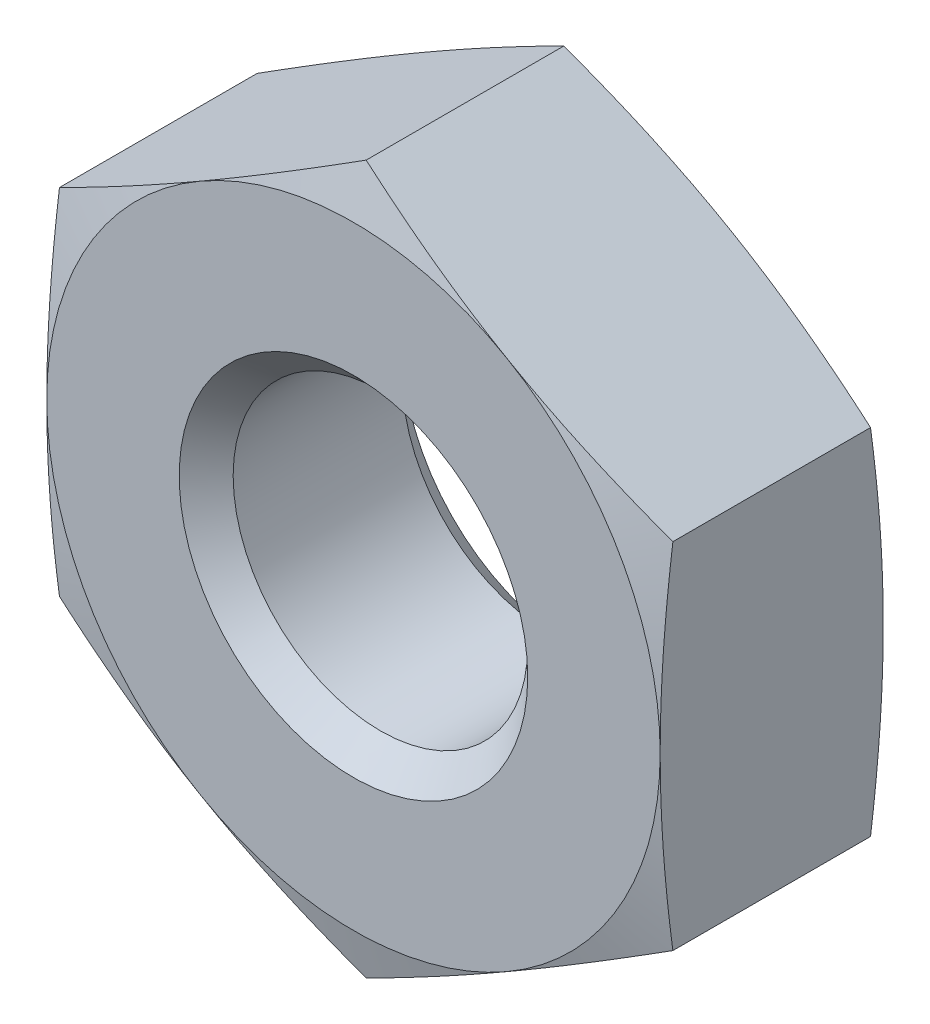
ISO-10303-21;
HEADER;
FILE_DESCRIPTION(('STEP AP214'),'2;1');
FILE_NAME('part.step','',(''),(''),'','','');
FILE_SCHEMA(('AUTOMOTIVE_DESIGN { 1 0 10303 214 1 1 1 1 }'));
ENDSEC;
DATA;
#1=APPLICATION_CONTEXT('core data for automotive mechanical design processes');
#2=APPLICATION_PROTOCOL_DEFINITION('international standard','automotive_design',2000,#1);
#3=PRODUCT_CONTEXT('',#1,'mechanical');
#4=PRODUCT('Part','Part','',(#3));
#5=PRODUCT_RELATED_PRODUCT_CATEGORY('part','',(#4));
#6=PRODUCT_DEFINITION_FORMATION('','',#4);
#7=PRODUCT_DEFINITION_CONTEXT('part definition',#1,'design');
#8=PRODUCT_DEFINITION('design','',#6,#7);
#9=PRODUCT_DEFINITION_SHAPE('','',#8);
#10=(LENGTH_UNIT() NAMED_UNIT(*) SI_UNIT(.MILLI.,.METRE.));
#11=(NAMED_UNIT(*) PLANE_ANGLE_UNIT() SI_UNIT($,.RADIAN.));
#12=(NAMED_UNIT(*) SI_UNIT($,.STERADIAN.) SOLID_ANGLE_UNIT());
#13=UNCERTAINTY_MEASURE_WITH_UNIT(LENGTH_MEASURE(1.E-05),#10,'distance_accuracy_value','');
#14=(GEOMETRIC_REPRESENTATION_CONTEXT(3) GLOBAL_UNCERTAINTY_ASSIGNED_CONTEXT((#13)) GLOBAL_UNIT_ASSIGNED_CONTEXT((#10,
#11,#12)) REPRESENTATION_CONTEXT('',''));
#15=CARTESIAN_POINT('',(0.,0.,0.));
#16=DIRECTION('',(0.,0.,1.));
#17=DIRECTION('',(1.,0.,0.));
#18=AXIS2_PLACEMENT_3D('',#15,#16,#17);
#19=CARTESIAN_POINT('',(0.,5.588,-4.064));
#20=DIRECTION('',(0.,0.,1.));
#21=DIRECTION('',(1.,0.,0.));
#22=AXIS2_PLACEMENT_3D('',#19,#20,#21);
#23=PLANE('',#22);
#24=CARTESIAN_POINT('',(0.,0.,-4.064000000026));
#25=DIRECTION('',(0.,0.,1.));
#26=DIRECTION('',(1.,0.,0.));
#27=AXIS2_PLACEMENT_3D('',#24,#25,#26);
#28=CIRCLE('',#27,5.58799999998882);
#29=CARTESIAN_POINT('',(2.7939999999972,4.83934995634261,-4.06400000002451));
#30=VERTEX_POINT('',#29);
#31=CARTESIAN_POINT('',(-2.7939999999972,4.8393499563426,-4.06400000002451));
#32=VERTEX_POINT('',#31);
#33=EDGE_CURVE('E131',#30,#32,#28,.T.);
#34=ORIENTED_EDGE('',*,*,#33,.F.);
#35=CARTESIAN_POINT('',(0.,0.,-4.064000000026));
#36=DIRECTION('',(0.,0.,1.));
#37=DIRECTION('',(1.,0.,0.));
#38=AXIS2_PLACEMENT_3D('',#35,#36,#37);
#39=CIRCLE('',#38,5.58799999998882);
#40=CARTESIAN_POINT('',(5.58799999999441,0.,-4.06400000002451));
#41=VERTEX_POINT('',#40);
#42=EDGE_CURVE('E128',#41,#30,#39,.T.);
#43=ORIENTED_EDGE('',*,*,#42,.F.);
#44=CARTESIAN_POINT('',(0.,0.,-4.064000000026));
#45=DIRECTION('',(0.,0.,1.));
#46=DIRECTION('',(1.,0.,0.));
#47=AXIS2_PLACEMENT_3D('',#44,#45,#46);
#48=CIRCLE('',#47,5.58799999998882);
#49=CARTESIAN_POINT('',(2.7939999999972,-4.83934995634261,-4.06400000002451));
#50=VERTEX_POINT('',#49);
#51=EDGE_CURVE('E20',#50,#41,#48,.T.);
#52=ORIENTED_EDGE('',*,*,#51,.F.);
#53=CARTESIAN_POINT('',(0.,0.,-4.064000000026));
#54=DIRECTION('',(0.,0.,1.));
#55=DIRECTION('',(1.,0.,0.));
#56=AXIS2_PLACEMENT_3D('',#53,#54,#55);
#57=CIRCLE('',#56,5.58799999998882);
#58=CARTESIAN_POINT('',(-2.7939999999972,-4.83934995634261,-4.06400000002451));
#59=VERTEX_POINT('',#58);
#60=EDGE_CURVE('E104',#59,#50,#57,.T.);
#61=ORIENTED_EDGE('',*,*,#60,.F.);
#62=CARTESIAN_POINT('',(0.,0.,-4.064000000026));
#63=DIRECTION('',(0.,0.,1.));
#64=DIRECTION('',(1.,0.,0.));
#65=AXIS2_PLACEMENT_3D('',#62,#63,#64);
#66=CIRCLE('',#65,5.58799999998882);
#67=CARTESIAN_POINT('',(-5.58799999999441,0.,-4.06400000002451));
#68=VERTEX_POINT('',#67);
#69=EDGE_CURVE('E136',#68,#59,#66,.T.);
#70=ORIENTED_EDGE('',*,*,#69,.F.);
#71=CARTESIAN_POINT('',(0.,0.,-4.064000000026));
#72=DIRECTION('',(0.,0.,1.));
#73=DIRECTION('',(1.,0.,0.));
#74=AXIS2_PLACEMENT_3D('',#71,#72,#73);
#75=CIRCLE('',#74,5.58799999998882);
#76=EDGE_CURVE('E412',#32,#68,#75,.T.);
#77=ORIENTED_EDGE('',*,*,#76,.F.);
#78=EDGE_LOOP('',(#34,#43,#52,#61,#70,#77));
#79=FACE_BOUND('',#78,.T.);
#80=CARTESIAN_POINT('',(0.,0.,-4.06400000002805));
#81=DIRECTION('',(0.,0.,-1.));
#82=DIRECTION('',(-1.,0.,0.));
#83=AXIS2_PLACEMENT_3D('',#80,#81,#82);
#84=CIRCLE('',#83,3.17499999999882);
#85=CARTESIAN_POINT('',(-3.17499999999882,0.,-4.06400000002805));
#86=VERTEX_POINT('',#85);
#87=EDGE_CURVE('E125',#86,#86,#84,.F.);
#88=ORIENTED_EDGE('',*,*,#87,.T.);
#89=EDGE_LOOP('',(#88));
#90=FACE_BOUND('',#89,.T.);
#91=ADVANCED_FACE('F17',(#79,#90),#23,.F.);
#92=CARTESIAN_POINT('',(0.,0.,-3.83097707165803));
#93=DIRECTION('',(0.,0.,1.));
#94=DIRECTION('',(1.,0.,0.));
#95=AXIS2_PLACEMENT_3D('',#92,#93,#94);
#96=CONICAL_SURFACE('',#95,6.45765340800608,1.30899693900135);
#97=CARTESIAN_POINT('',(2.79399999999999,-4.83934995634744,-4.06400000002301));
#98=CARTESIAN_POINT('',(2.91089048197917,-4.77186320511105,-4.06400613805041));
#99=CARTESIAN_POINT('',(3.02777767203443,-4.70437835446783,-4.06268908124278));
#100=CARTESIAN_POINT('',(3.26150490328894,-4.56943587458609,-4.0574605147276));
#101=CARTESIAN_POINT('',(3.3783449458841,-4.50197824454165,-4.05354908849101));
#102=CARTESIAN_POINT('',(3.72847238563638,-4.29983207295,-4.03801311347));
#103=CARTESIAN_POINT('',(3.96163987483682,-4.16521276029386,-4.02258663373282));
#104=CARTESIAN_POINT('',(4.42730452197151,-3.89636115091855,-3.98253825882312));
#105=CARTESIAN_POINT('',(4.65980182496363,-3.76212877045019,-3.95791853210183));
#106=CARTESIAN_POINT('',(5.12433854928225,-3.49392836761637,-3.90075946318869));
#107=CARTESIAN_POINT('',(5.35637714733395,-3.35996082056883,-3.86821113150756));
#108=CARTESIAN_POINT('',(5.58800000000257,-3.22623330423014,-3.8323668704064));
#109=B_SPLINE_CURVE_WITH_KNOTS('',3,(#97,#98,#99,#100,#101,#102,#103,#104,#105,#106,#107,#108),
.UNSPECIFIED.,.F.,.F.,(4,2,2,2,2,4),(0.,0.404906880860233,0.809800734922586,1.61864413081672,
2.42729686168546,3.23687074950759),.UNSPECIFIED.);
#110=CARTESIAN_POINT('',(5.58800000000161,-3.22623330423255,-3.8323668704063));
#111=VERTEX_POINT('',#110);
#112=EDGE_CURVE('E115',#50,#111,#109,.T.);
#113=ORIENTED_EDGE('',*,*,#112,.F.);
#114=ORIENTED_EDGE('',*,*,#51,.T.);
#115=CARTESIAN_POINT('',(5.58799999999305,-3.22623330423461,-3.83236687040081));
#116=CARTESIAN_POINT('',(5.58799999999751,-2.95877827155755,-3.86821113150552));
#117=CARTESIAN_POINT('',(5.58799999999933,-2.69084317746257,-3.9007594631881));
#118=CARTESIAN_POINT('',(5.58800000000067,-2.1544423717949,-3.95791853210232));
#119=CARTESIAN_POINT('',(5.58800000000018,-1.88597761085806,-3.98253825882323));
#120=CARTESIAN_POINT('',(5.58799999999983,-1.34827439210734,-4.02258663373267));
#121=CARTESIAN_POINT('',(5.58799999999997,-1.07903576679505,-4.03801311346996));
#122=CARTESIAN_POINT('',(5.58800000000002,-0.674743423611711,-4.05354908849102));
#123=CARTESIAN_POINT('',(5.58800000000001,-0.539828163522803,-4.05746051472761));
#124=CARTESIAN_POINT('',(5.58799999999999,-0.269943203759274,-4.06268908124277));
#125=CARTESIAN_POINT('',(5.58799999999998,-0.134973502472803,-4.0640061380504));
#126=CARTESIAN_POINT('',(5.588,0.,-4.06400000002301));
#127=B_SPLINE_CURVE_WITH_KNOTS('',3,(#115,#116,#117,#118,#119,#120,#121,#122,#123,#124,#125,
#126),.UNSPECIFIED.,.F.,.F.,(4,2,2,2,2,4),(0.,0.809573887822391,1.61822661869133,
2.42707001458552,2.83196386864794,3.23687074950825),.UNSPECIFIED.);
#128=EDGE_CURVE('E113',#111,#41,#127,.T.);
#129=ORIENTED_EDGE('',*,*,#128,.F.);
#130=EDGE_LOOP('',(#113,#114,#129));
#131=FACE_BOUND('',#130,.T.);
#132=ADVANCED_FACE('F112',(#131),#96,.T.);
#133=CARTESIAN_POINT('',(0.,0.,-3.83097707165803));
#134=DIRECTION('',(0.,0.,1.));
#135=DIRECTION('',(1.,0.,0.));
#136=AXIS2_PLACEMENT_3D('',#133,#134,#135);
#137=CONICAL_SURFACE('',#136,6.45765340800608,1.30899693900135);
#138=CARTESIAN_POINT('',(-2.794,-4.83934995634745,-4.06400000002301));
#139=CARTESIAN_POINT('',(-2.67710951802081,-4.90683670758384,-4.06400613805041));
#140=CARTESIAN_POINT('',(-2.56022232796556,-4.97432155822706,-4.06268908124278));
#141=CARTESIAN_POINT('',(-2.32649509671105,-5.1092640381088,-4.0574605147276));
#142=CARTESIAN_POINT('',(-2.20965505411589,-5.17672166815324,-4.05354908849101));
#143=CARTESIAN_POINT('',(-1.85952761436361,-5.37886783974489,-4.03801311347));
#144=CARTESIAN_POINT('',(-1.62636012516317,-5.51348715240103,-4.02258663373282));
#145=CARTESIAN_POINT('',(-1.16069547802849,-5.78233876177633,-3.98253825882312));
#146=CARTESIAN_POINT('',(-0.928198175036369,-5.9165711422447,-3.95791853210183));
#147=CARTESIAN_POINT('',(-0.46366145071775,-6.18477154507852,-3.90075946318868));
#148=CARTESIAN_POINT('',(-0.231622852666047,-6.31873909212605,-3.86821113150756));
#149=CARTESIAN_POINT('',(2.5725689760497E-12,-6.45246660846475,-3.8323668704064));
#150=B_SPLINE_CURVE_WITH_KNOTS('',3,(#138,#139,#140,#141,#142,#143,#144,#145,#146,#147,#148,
#149),.UNSPECIFIED.,.F.,.F.,(4,2,2,2,2,4),(0.,0.404906880860231,0.809800734922583,
1.61864413081671,2.42729686168545,3.23687074950758),.UNSPECIFIED.);
#151=CARTESIAN_POINT('',(0.,-6.45246660846511,-3.8323668704063));
#152=VERTEX_POINT('',#151);
#153=EDGE_CURVE('E276',#59,#152,#150,.T.);
#154=ORIENTED_EDGE('',*,*,#153,.F.);
#155=ORIENTED_EDGE('',*,*,#60,.T.);
#156=CARTESIAN_POINT('',(-6.06003807704887E-12,-6.45246660845872,-3.83236687040082));
#157=CARTESIAN_POINT('',(0.231622852664497,-6.31873909212406,-3.86821113150552));
#158=CARTESIAN_POINT('',(0.463661450717038,-6.18477154507814,-3.9007594631881));
#159=CARTESIAN_POINT('',(0.928198175036345,-5.91657114224546,-3.95791853210233));
#160=CARTESIAN_POINT('',(1.16069547802832,-5.78233876177662,-3.98253825882324));
#161=CARTESIAN_POINT('',(1.62636012516292,-5.51348715240096,-4.02258663373267));
#162=CARTESIAN_POINT('',(1.85952761436344,-5.37886783974494,-4.03801311346997));
#163=CARTESIAN_POINT('',(2.20965505411577,-5.17672166815331,-4.05354908849102));
#164=CARTESIAN_POINT('',(2.32649509671095,-5.10926403810885,-4.05746051472761));
#165=CARTESIAN_POINT('',(2.56022232796549,-4.97432155822707,-4.06268908124278));
#166=CARTESIAN_POINT('',(2.67710951802077,-4.90683670758383,-4.0640061380504));
#167=CARTESIAN_POINT('',(2.79399999999999,-4.83934995634744,-4.06400000002301));
#168=B_SPLINE_CURVE_WITH_KNOTS('',3,(#156,#157,#158,#159,#160,#161,#162,#163,#164,#165,#166,
#167),.UNSPECIFIED.,.F.,.F.,(4,2,2,2,2,4),(0.,0.809573887822391,1.61822661869133,
2.42707001458551,2.83196386864793,3.23687074950825),.UNSPECIFIED.);
#169=EDGE_CURVE('E140',#152,#50,#168,.T.);
#170=ORIENTED_EDGE('',*,*,#169,.F.);
#171=EDGE_LOOP('',(#154,#155,#170));
#172=FACE_BOUND('',#171,.T.);
#173=ADVANCED_FACE('F289',(#172),#137,.T.);
#174=CARTESIAN_POINT('',(0.,0.,-3.83097707165803));
#175=DIRECTION('',(0.,0.,1.));
#176=DIRECTION('',(1.,0.,0.));
#177=AXIS2_PLACEMENT_3D('',#174,#175,#176);
#178=CONICAL_SURFACE('',#177,6.45765340800608,1.30899693900135);
#179=ORIENTED_EDGE('',*,*,#69,.T.);
#180=CARTESIAN_POINT('',(-5.5879999999991,-3.22623330422413,-3.83236687040081));
#181=CARTESIAN_POINT('',(-5.35637714733301,-3.35996082056652,-3.86821113150551));
#182=CARTESIAN_POINT('',(-5.12433854928229,-3.49392836761559,-3.9007594631881));
#183=CARTESIAN_POINT('',(-4.65980182496431,-3.76212877045058,-3.95791853210232));
#184=CARTESIAN_POINT('',(-4.42730452197185,-3.89636115091857,-3.98253825882323));
#185=CARTESIAN_POINT('',(-3.96163987483689,-4.16521276029363,-4.02258663373267));
#186=CARTESIAN_POINT('',(-3.72847238563652,-4.29983207294989,-4.03801311346996));
#187=CARTESIAN_POINT('',(-3.37834494588424,-4.50197824454161,-4.05354908849102));
#188=CARTESIAN_POINT('',(-3.26150490328905,-4.56943587458606,-4.05746051472761));
#189=CARTESIAN_POINT('',(-3.02777767203448,-4.70437835446781,-4.06268908124277));
#190=CARTESIAN_POINT('',(-2.9108904819792,-4.77186320511103,-4.0640061380504));
#191=CARTESIAN_POINT('',(-2.794,-4.83934995634745,-4.06400000002301));
#192=B_SPLINE_CURVE_WITH_KNOTS('',3,(#180,#181,#182,#183,#184,#185,#186,#187,#188,#189,#190,
#191),.UNSPECIFIED.,.F.,.F.,(4,2,2,2,2,4),(0.,0.809573887822391,1.61822661869133,
2.42707001458552,2.83196386864794,3.23687074950825),.UNSPECIFIED.);
#193=CARTESIAN_POINT('',(-5.58800000000161,-3.22623330423256,-3.8323668704063));
#194=VERTEX_POINT('',#193);
#195=EDGE_CURVE('E281',#194,#59,#192,.T.);
#196=ORIENTED_EDGE('',*,*,#195,.F.);
#197=CARTESIAN_POINT('',(-5.588,0.,-4.06400000002301));
#198=CARTESIAN_POINT('',(-5.588,-0.134973502472776,-4.06400613805041));
#199=CARTESIAN_POINT('',(-5.588,-0.269943203759218,-4.06268908124278));
#200=CARTESIAN_POINT('',(-5.588,-0.539828163522696,-4.0574605147276));
#201=CARTESIAN_POINT('',(-5.588,-0.674743423611582,-4.05354908849101));
#202=CARTESIAN_POINT('',(-5.588,-1.07903576679489,-4.03801311347));
#203=CARTESIAN_POINT('',(-5.588,-1.34827439210717,-4.02258663373282));
#204=CARTESIAN_POINT('',(-5.588,-1.88597761085778,-3.98253825882312));
#205=CARTESIAN_POINT('',(-5.588,-2.1544423717945,-3.95791853210183));
#206=CARTESIAN_POINT('',(-5.588,-2.69084317746215,-3.90075946318868));
#207=CARTESIAN_POINT('',(-5.588,-2.95877827155722,-3.86821113150756));
#208=CARTESIAN_POINT('',(-5.588,-3.22623330423461,-3.8323668704064));
#209=B_SPLINE_CURVE_WITH_KNOTS('',3,(#197,#198,#199,#200,#201,#202,#203,#204,#205,#206,#207,
#208),.UNSPECIFIED.,.F.,.F.,(4,2,2,2,2,4),(0.,0.404906880860233,0.809800734922587,
1.61864413081672,2.42729686168547,3.23687074950759),.UNSPECIFIED.);
#210=EDGE_CURVE('E183',#68,#194,#209,.T.);
#211=ORIENTED_EDGE('',*,*,#210,.F.);
#212=EDGE_LOOP('',(#179,#196,#211));
#213=FACE_BOUND('',#212,.T.);
#214=ADVANCED_FACE('F165',(#213),#178,.T.);
#215=CARTESIAN_POINT('',(0.,0.,-3.83097707165803));
#216=DIRECTION('',(0.,0.,1.));
#217=DIRECTION('',(1.,0.,0.));
#218=AXIS2_PLACEMENT_3D('',#215,#216,#217);
#219=CONICAL_SURFACE('',#218,6.45765340800608,1.30899693900135);
#220=CARTESIAN_POINT('',(5.588,0.,-4.06400000002301));
#221=CARTESIAN_POINT('',(5.588,0.134973502472776,-4.06400613805041));
#222=CARTESIAN_POINT('',(5.588,0.269943203759219,-4.06268908124278));
#223=CARTESIAN_POINT('',(5.588,0.539828163522697,-4.0574605147276));
#224=CARTESIAN_POINT('',(5.588,0.674743423611582,-4.05354908849101));
#225=CARTESIAN_POINT('',(5.588,1.07903576679489,-4.03801311347));
#226=CARTESIAN_POINT('',(5.588,1.34827439210717,-4.02258663373282));
#227=CARTESIAN_POINT('',(5.588,1.88597761085778,-3.98253825882312));
#228=CARTESIAN_POINT('',(5.588,2.1544423717945,-3.95791853210183));
#229=CARTESIAN_POINT('',(5.588,2.69084317746215,-3.90075946318868));
#230=CARTESIAN_POINT('',(5.588,2.95877827155722,-3.86821113150756));
#231=CARTESIAN_POINT('',(5.588,3.22623330423461,-3.8323668704064));
#232=B_SPLINE_CURVE_WITH_KNOTS('',3,(#220,#221,#222,#223,#224,#225,#226,#227,#228,#229,#230,
#231),.UNSPECIFIED.,.F.,.F.,(4,2,2,2,2,4),(0.,0.404906880860234,0.809800734922587,
1.61864413081672,2.42729686168547,3.23687074950759),.UNSPECIFIED.);
#233=CARTESIAN_POINT('',(5.588,3.22623330423349,-3.83236687040655));
#234=VERTEX_POINT('',#233);
#235=EDGE_CURVE('E121',#41,#234,#232,.T.);
#236=ORIENTED_EDGE('',*,*,#235,.F.);
#237=ORIENTED_EDGE('',*,*,#42,.T.);
#238=CARTESIAN_POINT('',(5.5879999999991,3.22623330422413,-3.83236687040081));
#239=CARTESIAN_POINT('',(5.356377147333,3.35996082056652,-3.86821113150551));
#240=CARTESIAN_POINT('',(5.12433854928229,3.49392836761559,-3.9007594631881));
#241=CARTESIAN_POINT('',(4.65980182496431,3.76212877045058,-3.95791853210232));
#242=CARTESIAN_POINT('',(4.42730452197185,3.89636115091857,-3.98253825882323));
#243=CARTESIAN_POINT('',(3.96163987483689,4.16521276029363,-4.02258663373267));
#244=CARTESIAN_POINT('',(3.72847238563652,4.29983207294989,-4.03801311346996));
#245=CARTESIAN_POINT('',(3.37834494588423,4.50197824454161,-4.05354908849102));
#246=CARTESIAN_POINT('',(3.26150490328905,4.56943587458606,-4.05746051472761));
#247=CARTESIAN_POINT('',(3.02777767203448,4.70437835446781,-4.06268908124277));
#248=CARTESIAN_POINT('',(2.9108904819792,4.77186320511104,-4.0640061380504));
#249=CARTESIAN_POINT('',(2.794,4.83934995634745,-4.06400000002301));
#250=B_SPLINE_CURVE_WITH_KNOTS('',3,(#238,#239,#240,#241,#242,#243,#244,#245,#246,#247,#248,
#249),.UNSPECIFIED.,.F.,.F.,(4,2,2,2,2,4),(0.,0.809573887822392,1.61822661869133,
2.42707001458552,2.83196386864794,3.23687074950826),.UNSPECIFIED.);
#251=EDGE_CURVE('E139',#234,#30,#250,.T.);
#252=ORIENTED_EDGE('',*,*,#251,.F.);
#253=EDGE_LOOP('',(#236,#237,#252));
#254=FACE_BOUND('',#253,.T.);
#255=ADVANCED_FACE('F138',(#254),#219,.T.);
#256=CARTESIAN_POINT('',(0.,0.,-3.83097707165803));
#257=DIRECTION('',(0.,0.,1.));
#258=DIRECTION('',(1.,0.,0.));
#259=AXIS2_PLACEMENT_3D('',#256,#257,#258);
#260=CONICAL_SURFACE('',#259,6.45765340800608,1.30899693900135);
#261=CARTESIAN_POINT('',(2.794,4.83934995634745,-4.06400000002301));
#262=CARTESIAN_POINT('',(2.67710951802081,4.90683670758384,-4.06400613805041));
#263=CARTESIAN_POINT('',(2.56022232796556,4.97432155822706,-4.06268908124278));
#264=CARTESIAN_POINT('',(2.32649509671104,5.1092640381088,-4.0574605147276));
#265=CARTESIAN_POINT('',(2.20965505411589,5.17672166815324,-4.05354908849101));
#266=CARTESIAN_POINT('',(1.85952761436361,5.37886783974489,-4.03801311347));
#267=CARTESIAN_POINT('',(1.62636012516317,5.51348715240103,-4.02258663373282));
#268=CARTESIAN_POINT('',(1.16069547802849,5.78233876177633,-3.98253825882312));
#269=CARTESIAN_POINT('',(0.928198175036368,5.9165711422447,-3.95791853210183));
#270=CARTESIAN_POINT('',(0.463661450717749,6.18477154507852,-3.90075946318868));
#271=CARTESIAN_POINT('',(0.231622852666046,6.31873909212605,-3.86821113150756));
#272=CARTESIAN_POINT('',(-2.57232619679129E-12,6.45246660846475,-3.8323668704064));
#273=B_SPLINE_CURVE_WITH_KNOTS('',3,(#261,#262,#263,#264,#265,#266,#267,#268,#269,#270,#271,
#272),.UNSPECIFIED.,.F.,.F.,(4,2,2,2,2,4),(0.,0.404906880860231,0.809800734922582,
1.61864413081671,2.42729686168545,3.23687074950757),.UNSPECIFIED.);
#274=CARTESIAN_POINT('',(-1.60443338014632E-12,6.45246660846418,-3.83236687040655));
#275=VERTEX_POINT('',#274);
#276=EDGE_CURVE('E177',#30,#275,#273,.T.);
#277=ORIENTED_EDGE('',*,*,#276,.F.);
#278=ORIENTED_EDGE('',*,*,#33,.T.);
#279=CARTESIAN_POINT('',(6.05815025700102E-12,6.45246660845872,-3.83236687040082));
#280=CARTESIAN_POINT('',(-0.231622852664499,6.31873909212405,-3.86821113150552));
#281=CARTESIAN_POINT('',(-0.46366145071704,6.18477154507814,-3.9007594631881));
#282=CARTESIAN_POINT('',(-0.928198175036347,5.91657114224546,-3.95791853210233));
#283=CARTESIAN_POINT('',(-1.16069547802832,5.78233876177662,-3.98253825882324));
#284=CARTESIAN_POINT('',(-1.62636012516292,5.51348715240096,-4.02258663373267));
#285=CARTESIAN_POINT('',(-1.85952761436344,5.37886783974494,-4.03801311346997));
#286=CARTESIAN_POINT('',(-2.20965505411577,5.17672166815331,-4.05354908849102));
#287=CARTESIAN_POINT('',(-2.32649509671095,5.10926403810885,-4.05746051472761));
#288=CARTESIAN_POINT('',(-2.5602223279655,4.97432155822707,-4.06268908124278));
#289=CARTESIAN_POINT('',(-2.67710951802077,4.90683670758383,-4.0640061380504));
#290=CARTESIAN_POINT('',(-2.79399999999999,4.83934995634744,-4.06400000002301));
#291=B_SPLINE_CURVE_WITH_KNOTS('',3,(#279,#280,#281,#282,#283,#284,#285,#286,#287,#288,#289,
#290),.UNSPECIFIED.,.F.,.F.,(4,2,2,2,2,4),(0.,0.80957388782239,1.61822661869133,
2.42707001458551,2.83196386864793,3.23687074950825),.UNSPECIFIED.);
#292=EDGE_CURVE('E343',#275,#32,#291,.T.);
#293=ORIENTED_EDGE('',*,*,#292,.F.);
#294=EDGE_LOOP('',(#277,#278,#293));
#295=FACE_BOUND('',#294,.T.);
#296=ADVANCED_FACE('F164',(#295),#260,.T.);
#297=CARTESIAN_POINT('',(0.,0.,-3.83097707165803));
#298=DIRECTION('',(0.,0.,1.));
#299=DIRECTION('',(1.,0.,0.));
#300=AXIS2_PLACEMENT_3D('',#297,#298,#299);
#301=CONICAL_SURFACE('',#300,6.45765340800608,1.30899693900135);
#302=ORIENTED_EDGE('',*,*,#76,.T.);
#303=CARTESIAN_POINT('',(-5.58799999999305,3.22623330423461,-3.83236687040081));
#304=CARTESIAN_POINT('',(-5.58799999999751,2.95877827155755,-3.86821113150552));
#305=CARTESIAN_POINT('',(-5.58799999999933,2.69084317746257,-3.9007594631881));
#306=CARTESIAN_POINT('',(-5.58800000000067,2.1544423717949,-3.95791853210232));
#307=CARTESIAN_POINT('',(-5.58800000000018,1.88597761085806,-3.98253825882323));
#308=CARTESIAN_POINT('',(-5.58799999999983,1.34827439210734,-4.02258663373267));
#309=CARTESIAN_POINT('',(-5.58799999999997,1.07903576679505,-4.03801311346996));
#310=CARTESIAN_POINT('',(-5.58800000000002,0.674743423611712,-4.05354908849102));
#311=CARTESIAN_POINT('',(-5.58800000000001,0.539828163522803,-4.05746051472761));
#312=CARTESIAN_POINT('',(-5.58799999999999,0.269943203759274,-4.06268908124277));
#313=CARTESIAN_POINT('',(-5.58799999999998,0.134973502472803,-4.0640061380504));
#314=CARTESIAN_POINT('',(-5.588,0.,-4.06400000002301));
#315=B_SPLINE_CURVE_WITH_KNOTS('',3,(#303,#304,#305,#306,#307,#308,#309,#310,#311,#312,#313,
#314),.UNSPECIFIED.,.F.,.F.,(4,2,2,2,2,4),(0.,0.809573887822391,1.61822661869133,
2.42707001458552,2.83196386864794,3.23687074950825),.UNSPECIFIED.);
#316=CARTESIAN_POINT('',(-5.58800000000161,3.22623330423256,-3.8323668704063));
#317=VERTEX_POINT('',#316);
#318=EDGE_CURVE('E282',#317,#68,#315,.T.);
#319=ORIENTED_EDGE('',*,*,#318,.F.);
#320=CARTESIAN_POINT('',(-2.79399999999999,4.83934995634744,-4.06400000002301));
#321=CARTESIAN_POINT('',(-2.91089048197918,4.77186320511105,-4.06400613805041));
#322=CARTESIAN_POINT('',(-3.02777767203443,4.70437835446783,-4.06268908124278));
#323=CARTESIAN_POINT('',(-3.26150490328894,4.56943587458609,-4.0574605147276));
#324=CARTESIAN_POINT('',(-3.37834494588411,4.50197824454165,-4.05354908849101));
#325=CARTESIAN_POINT('',(-3.72847238563639,4.29983207295,-4.03801311347));
#326=CARTESIAN_POINT('',(-3.96163987483682,4.16521276029385,-4.02258663373282));
#327=CARTESIAN_POINT('',(-4.42730452197151,3.89636115091855,-3.98253825882312));
#328=CARTESIAN_POINT('',(-4.65980182496363,3.76212877045019,-3.95791853210183));
#329=CARTESIAN_POINT('',(-5.12433854928225,3.49392836761637,-3.90075946318869));
#330=CARTESIAN_POINT('',(-5.35637714733395,3.35996082056883,-3.86821113150756));
#331=CARTESIAN_POINT('',(-5.58800000000257,3.22623330423014,-3.8323668704064));
#332=B_SPLINE_CURVE_WITH_KNOTS('',3,(#320,#321,#322,#323,#324,#325,#326,#327,#328,#329,#330,
#331),.UNSPECIFIED.,.F.,.F.,(4,2,2,2,2,4),(0.,0.404906880860233,0.809800734922585,
1.61864413081672,2.42729686168546,3.23687074950759),.UNSPECIFIED.);
#333=EDGE_CURVE('E339',#32,#317,#332,.T.);
#334=ORIENTED_EDGE('',*,*,#333,.F.);
#335=EDGE_LOOP('',(#302,#319,#334));
#336=FACE_BOUND('',#335,.T.);
#337=ADVANCED_FACE('F418',(#336),#301,.T.);
#338=CARTESIAN_POINT('',(0.,0.,-4.06400000002805));
#339=DIRECTION('',(0.,0.,-1.));
#340=DIRECTION('',(-1.,0.,0.));
#341=AXIS2_PLACEMENT_3D('',#338,#339,#340);
#342=CONICAL_SURFACE('',#341,3.17499999999882,0.785398163397448);
#343=CARTESIAN_POINT('',(0.,0.,-3.57251));
#344=DIRECTION('',(0.,0.,1.));
#345=DIRECTION('',(1.,0.,0.));
#346=AXIS2_PLACEMENT_3D('',#343,#344,#345);
#347=CIRCLE('',#346,2.68351);
#348=CARTESIAN_POINT('',(2.68351,0.,-3.57251));
#349=VERTEX_POINT('',#348);
#350=EDGE_CURVE('E332',#349,#349,#347,.T.);
#351=ORIENTED_EDGE('',*,*,#350,.T.);
#352=EDGE_LOOP('',(#351));
#353=FACE_BOUND('',#352,.T.);
#354=ORIENTED_EDGE('',*,*,#87,.F.);
#355=EDGE_LOOP('',(#354));
#356=FACE_BOUND('',#355,.T.);
#357=ADVANCED_FACE('F416',(#353,#356),#342,.F.);
#358=CARTESIAN_POINT('',(5.588,-3.22623330423164,-4.064));
#359=DIRECTION('',(1.,0.,0.));
#360=DIRECTION('',(0.,0.,-1.));
#361=AXIS2_PLACEMENT_3D('',#358,#359,#360);
#362=PLANE('',#361);
#363=ORIENTED_EDGE('',*,*,#235,.T.);
#364=DIRECTION('',(0.,0.,1.));
#365=VECTOR('',#364,1.);
#366=CARTESIAN_POINT('',(5.588,3.22623330423164,-4.064));
#367=LINE('',#366,#365);
#368=CARTESIAN_POINT('',(5.588,3.22623332711371,-0.231633132658444));
#369=VERTEX_POINT('',#368);
#370=EDGE_CURVE('E178',#369,#234,#367,.F.);
#371=ORIENTED_EDGE('',*,*,#370,.F.);
#372=CARTESIAN_POINT('',(5.588,0.,2.33865474576924E-11));
#373=CARTESIAN_POINT('',(5.588,0.134973504400605,6.13805113475887E-06));
#374=CARTESIAN_POINT('',(5.588,0.269943207614708,-0.00131091879430666));
#375=CARTESIAN_POINT('',(5.588,0.53982817123107,-0.00653948545847716));
#376=CARTESIAN_POINT('',(5.588,0.67474343324518,-0.0104509118062404));
#377=CARTESIAN_POINT('',(5.588,1.07903578218717,-0.0259868872658269));
#378=CARTESIAN_POINT('',(5.588,1.34827441132708,-0.0414133674354804));
#379=CARTESIAN_POINT('',(5.588,1.88597763770162,-0.0814617434389431));
#380=CARTESIAN_POINT('',(5.588,2.15444240243468,-0.10608147082137));
#381=CARTESIAN_POINT('',(5.588,2.69084321567823,-0.163240541226211));
#382=CARTESIAN_POINT('',(5.588,2.95877831355282,-0.195788873738281));
#383=CARTESIAN_POINT('',(5.588,3.22623334999578,-0.231633135724061));
#384=B_SPLINE_CURVE_WITH_KNOTS('',3,(#372,#373,#374,#375,#376,#377,#378,#379,#380,#381,#382,
#383),.UNSPECIFIED.,.F.,.F.,(4,2,2,2,2,4),(0.,0.404906886643133,0.809800746487453,
1.61864415391211,2.4272968962998,3.2368707956737),.UNSPECIFIED.);
#385=CARTESIAN_POINT('',(5.58799999999441,0.,2.48838229923133E-11));
#386=VERTEX_POINT('',#385);
#387=EDGE_CURVE('E389',#386,#369,#384,.T.);
#388=ORIENTED_EDGE('',*,*,#387,.F.);
#389=CARTESIAN_POINT('',(5.588,-3.22623320762845,-0.231633116650456));
#390=CARTESIAN_POINT('',(5.588,-2.95877818290053,-0.195788857416812));
#391=CARTESIAN_POINT('',(5.588,-2.69084309678439,-0.163240527489882));
#392=CARTESIAN_POINT('',(5.588,-2.15444230711019,-0.106081461725849));
#393=CARTESIAN_POINT('',(5.588,-1.88597755418789,-0.0814617364002843));
#394=CARTESIAN_POINT('',(5.588,-1.34827435153214,-0.0414133637996232));
#395=CARTESIAN_POINT('',(5.588,-1.07903573430032,-0.0259868849754276));
#396=CARTESIAN_POINT('',(5.588,-0.674743403274144,-0.0104509108802863));
#397=CARTESIAN_POINT('',(5.588,-0.53982814724959,-0.00653948487839538));
#398=CARTESIAN_POINT('',(5.588,-0.269943195619917,-0.00131091867774982));
#399=CARTESIAN_POINT('',(5.588,-0.134973498402948,6.1380500611794E-06));
#400=CARTESIAN_POINT('',(5.588,0.,2.33865134630576E-11));
#401=B_SPLINE_CURVE_WITH_KNOTS('',3,(#389,#390,#391,#392,#393,#394,#395,#396,#397,#398,#399,
#400),.UNSPECIFIED.,.F.,.F.,(4,2,2,2,2,4),(0.,0.809573863435232,1.61822656998641,
2.4270699415385,2.83196378339457,3.23687065204656),.UNSPECIFIED.);
#402=CARTESIAN_POINT('',(5.58800001980971,-3.22623329279448,-0.231633132657398));
#403=VERTEX_POINT('',#402);
#404=EDGE_CURVE('E366',#403,#386,#401,.T.);
#405=ORIENTED_EDGE('',*,*,#404,.F.);
#406=DIRECTION('',(0.,0.,1.));
#407=VECTOR('',#406,1.);
#408=CARTESIAN_POINT('',(5.58799999999999,-3.22623330423162,-4.064));
#409=LINE('',#408,#407);
#410=EDGE_CURVE('E124',#111,#403,#409,.T.);
#411=ORIENTED_EDGE('',*,*,#410,.F.);
#412=ORIENTED_EDGE('',*,*,#128,.T.);
#413=EDGE_LOOP('',(#363,#371,#388,#405,#411,#412));
#414=FACE_BOUND('',#413,.T.);
#415=ADVANCED_FACE('F119',(#414),#362,.T.);
#416=CARTESIAN_POINT('',(0.,-6.45246660846325,-4.064));
#417=DIRECTION('',(0.5,-0.866025403784439,0.));
#418=DIRECTION('',(0.866025403784439,0.5,0.));
#419=AXIS2_PLACEMENT_3D('',#416,#417,#418);
#420=PLANE('',#419);
#421=ORIENTED_EDGE('',*,*,#112,.T.);
#422=ORIENTED_EDGE('',*,*,#410,.T.);
#423=CARTESIAN_POINT('',(2.79399999999999,-4.83934995634744,2.33884021902709E-11));
#424=CARTESIAN_POINT('',(2.91089048364816,-4.77186320414746,6.13805113670551E-06));
#425=CARTESIAN_POINT('',(3.02777767537225,-4.70437835254074,-0.00131091879429178));
#426=CARTESIAN_POINT('',(3.26150490996232,-4.56943587073322,-0.00653948545841156));
#427=CARTESIAN_POINT('',(3.37834495422421,-4.50197823972649,-0.010450911806137));
#428=CARTESIAN_POINT('',(3.72847239896196,-4.29983206525647,-0.0259868872655743));
#429=CARTESIAN_POINT('',(3.96163989147608,-4.16521275068717,-0.0414133674350804));
#430=CARTESIAN_POINT('',(4.42730454521104,-3.8963611375012,-0.0814617434381707));
#431=CARTESIAN_POINT('',(4.65980185148976,-3.76212875513532,-0.106081470820373));
#432=CARTESIAN_POINT('',(5.12433858236708,-3.49392834851483,-0.163240541224705));
#433=CARTESIAN_POINT('',(5.35637718369083,-3.35996079957818,-0.195788873736493));
#434=CARTESIAN_POINT('',(5.58800003961941,-3.22623328135734,-0.231633135721971));
#435=B_SPLINE_CURVE_WITH_KNOTS('',3,(#423,#424,#425,#426,#427,#428,#429,#430,#431,#432,#433,
#434),.UNSPECIFIED.,.F.,.F.,(4,2,2,2,2,4),(0.,0.404906886641165,0.809800746483515,
1.61864415390425,2.42729689628801,3.23687079565798),.UNSPECIFIED.);
#436=CARTESIAN_POINT('',(2.7939999999972,-4.8393499563426,2.48848454715631E-11));
#437=VERTEX_POINT('',#436);
#438=EDGE_CURVE('E365',#437,#403,#435,.T.);
#439=ORIENTED_EDGE('',*,*,#438,.F.);
#440=CARTESIAN_POINT('',(8.36753202976915E-08,-6.45246656014915,-0.231633116650801));
#441=CARTESIAN_POINT('',(0.231622929459149,-6.31873904778804,-0.1957888574157));
#442=CARTESIAN_POINT('',(0.463661520599986,-6.18477150473158,-0.163240527488363));
#443=CARTESIAN_POINT('',(0.928198231065524,-5.91657110989663,-0.106081461724391));
#444=CARTESIAN_POINT('',(1.16069552711553,-5.78233873343601,-0.0814617363992919));
#445=CARTESIAN_POINT('',(1.6263601603089,-5.51348713210952,-0.0414133637992178));
#446=CARTESIAN_POINT('',(1.85952764251012,-5.37886782349446,-0.0259868849751417));
#447=CARTESIAN_POINT('',(2.209655071732,-5.17672165798257,-0.010450910880157));
#448=CARTESIAN_POINT('',(2.32649511080666,-5.10926402997068,-0.00653948487831448));
#449=CARTESIAN_POINT('',(2.56022233501574,-4.97432155415661,-0.00131091867773609));
#450=CARTESIAN_POINT('',(2.67710952154605,-4.90683670554851,6.13805005609877E-06));
#451=CARTESIAN_POINT('',(2.79399999999999,-4.83934995634744,2.33884704347056E-11));
#452=B_SPLINE_CURVE_WITH_KNOTS('',3,(#440,#441,#442,#443,#444,#445,#446,#447,#448,#449,#450,
#451),.UNSPECIFIED.,.F.,.F.,(4,2,2,2,2,4),(0.,0.809573863430616,1.61822656997715,
2.42706994152453,2.83196378337826,3.2368706520279),.UNSPECIFIED.);
#453=CARTESIAN_POINT('',(1.98176945610757E-08,-6.45246661990501,-0.231633132658637));
#454=VERTEX_POINT('',#453);
#455=EDGE_CURVE('E363',#454,#437,#452,.T.);
#456=ORIENTED_EDGE('',*,*,#455,.F.);
#457=DIRECTION('',(0.,0.,1.));
#458=VECTOR('',#457,1.);
#459=CARTESIAN_POINT('',(0.,-6.45246660846326,-4.064));
#460=LINE('',#459,#458);
#461=EDGE_CURVE('E280',#152,#454,#460,.T.);
#462=ORIENTED_EDGE('',*,*,#461,.F.);
#463=ORIENTED_EDGE('',*,*,#169,.T.);
#464=EDGE_LOOP('',(#421,#422,#439,#456,#462,#463));
#465=FACE_BOUND('',#464,.T.);
#466=ADVANCED_FACE('F263',(#465),#420,.T.);
#467=CARTESIAN_POINT('',(-5.588,-3.22623330423164,-4.064));
#468=DIRECTION('',(-0.5,-0.866025403784439,0.));
#469=DIRECTION('',(0.866025403784439,-0.5,0.));
#470=AXIS2_PLACEMENT_3D('',#467,#468,#469);
#471=PLANE('',#470);
#472=ORIENTED_EDGE('',*,*,#153,.T.);
#473=ORIENTED_EDGE('',*,*,#461,.T.);
#474=CARTESIAN_POINT('',(-2.794,-4.83934995634745,2.33846090192839E-11));
#475=CARTESIAN_POINT('',(-2.67710951635116,-4.90683670854782,6.13805113301508E-06));
#476=CARTESIAN_POINT('',(-2.56022232462639,-4.97432156015493,-0.00131091879431074));
#477=CARTESIAN_POINT('',(-2.32649509003498,-5.10926404196323,-0.0065394854584906));
#478=CARTESIAN_POINT('',(-2.20965504577242,-5.17672167297034,-0.0104509118062609));
#479=CARTESIAN_POINT('',(-1.85952760103266,-5.37886784744152,-0.0259868872658749));
#480=CARTESIAN_POINT('',(-1.6263601085172,-5.51348716201159,-0.0414133674355554));
#481=CARTESIAN_POINT('',(-1.16069545477958,-5.7823387751991,-0.0814617434390865));
#482=CARTESIAN_POINT('',(-0.928198148499533,-5.91657115756575,-0.106081470821555));
#483=CARTESIAN_POINT('',(-0.463661417619576,-6.18477156418776,-0.163240541226489));
#484=CARTESIAN_POINT('',(-0.231622816294507,-6.31873911312517,-0.195788873738611));
#485=CARTESIAN_POINT('',(3.96353940700518E-08,-6.45246663134677,-0.231633135724445));
#486=B_SPLINE_CURVE_WITH_KNOTS('',3,(#474,#475,#476,#477,#478,#479,#480,#481,#482,#483,#484,
#485),.UNSPECIFIED.,.F.,.F.,(4,2,2,2,2,4),(0.,0.404906886643494,0.809800746488175,
1.61864415391355,2.42729689630196,3.23687079567658),.UNSPECIFIED.);
#487=CARTESIAN_POINT('',(-2.7939999999972,-4.83934995634261,2.48829769472867E-11));
#488=VERTEX_POINT('',#487);
#489=EDGE_CURVE('E270',#488,#454,#486,.T.);
#490=ORIENTED_EDGE('',*,*,#489,.F.);
#491=CARTESIAN_POINT('',(-5.58800003963624,-3.22623328134764,-0.231633135724576));
#492=CARTESIAN_POINT('',(-5.35637718370627,-3.35996079956928,-0.195788873738723));
#493=CARTESIAN_POINT('',(-5.12433858238113,-3.49392834850673,-0.163240541226582));
#494=CARTESIAN_POINT('',(-4.65980185150103,-3.76212875512883,-0.106081470821617));
#495=CARTESIAN_POINT('',(-4.42730454522091,-3.89636113749552,-0.0814617434391345));
#496=CARTESIAN_POINT('',(-3.96163989148315,-4.16521275068311,-0.0414133674355798));
#497=CARTESIAN_POINT('',(-3.72847239896762,-4.29983206525322,-0.0259868872658899));
#498=CARTESIAN_POINT('',(-3.37834495422775,-4.50197823972446,-0.0104509118062667));
#499=CARTESIAN_POINT('',(-3.26150490996516,-4.5694358707316,-0.00653948545849419));
#500=CARTESIAN_POINT('',(-3.02777767537367,-4.70437835253994,-0.00131091879431141));
#501=CARTESIAN_POINT('',(-2.91089048364887,-4.77186320414707,6.13805113305119E-06));
#502=CARTESIAN_POINT('',(-2.794,-4.83934995634745,2.33847092281487E-11));
#503=B_SPLINE_CURVE_WITH_KNOTS('',3,(#491,#492,#493,#494,#495,#496,#497,#498,#499,#500,#501,
#502),.UNSPECIFIED.,.F.,.F.,(4,2,2,2,2,4),(0.,0.809573899374868,1.61822664176352,
2.42707004918915,2.83196390903396,3.23687079567758),.UNSPECIFIED.);
#504=CARTESIAN_POINT('',(-5.588,-3.22623325592034,-0.231633123120341));
#505=VERTEX_POINT('',#504);
#506=EDGE_CURVE('E250',#505,#488,#503,.T.);
#507=ORIENTED_EDGE('',*,*,#506,.F.);
#508=DIRECTION('',(0.,0.,1.));
#509=VECTOR('',#508,1.);
#510=CARTESIAN_POINT('',(-5.588,-3.22623330423164,-4.064));
#511=LINE('',#510,#509);
#512=EDGE_CURVE('E344',#194,#505,#511,.T.);
#513=ORIENTED_EDGE('',*,*,#512,.F.);
#514=ORIENTED_EDGE('',*,*,#195,.T.);
#515=EDGE_LOOP('',(#472,#473,#490,#507,#513,#514));
#516=FACE_BOUND('',#515,.T.);
#517=ADVANCED_FACE('F260',(#516),#471,.T.);
#518=CARTESIAN_POINT('',(-5.588,3.22623330423164,-4.064));
#519=DIRECTION('',(-1.,0.,0.));
#520=DIRECTION('',(0.,0.,1.));
#521=AXIS2_PLACEMENT_3D('',#518,#519,#520);
#522=PLANE('',#521);
#523=ORIENTED_EDGE('',*,*,#210,.T.);
#524=ORIENTED_EDGE('',*,*,#512,.T.);
#525=CARTESIAN_POINT('',(-5.588,0.,2.33865474576924E-11));
#526=CARTESIAN_POINT('',(-5.588,-0.134973498402116,6.13805006111212E-06));
#527=CARTESIAN_POINT('',(-5.588,-0.269943195618252,-0.00131091867773359));
#528=CARTESIAN_POINT('',(-5.588,-0.539828147246261,-0.00653948487831492));
#529=CARTESIAN_POINT('',(-5.588,-0.674743403269983,-0.010450910880158));
#530=CARTESIAN_POINT('',(-5.588,-1.07903573429367,-0.0259868849751099));
#531=CARTESIAN_POINT('',(-5.588,-1.34827435152384,-0.0414133637991185));
#532=CARTESIAN_POINT('',(-5.588,-1.88597755417629,-0.0814617363993069));
#533=CARTESIAN_POINT('',(-5.588,-2.15444230709696,-0.106081461724587));
#534=CARTESIAN_POINT('',(-5.588,-2.69084309676788,-0.163240527487975));
#535=CARTESIAN_POINT('',(-5.588,-2.95877818288239,-0.195788857414546));
#536=CARTESIAN_POINT('',(-5.588,-3.22623320760869,-0.231633116647807));
#537=B_SPLINE_CURVE_WITH_KNOTS('',3,(#525,#526,#527,#528,#529,#530,#531,#532,#533,#534,#535,
#536),.UNSPECIFIED.,.F.,.F.,(4,2,2,2,2,4),(0.,0.404906868649485,0.80980071050306,
1.61864408205017,2.42729678859637,3.23687065202662),.UNSPECIFIED.);
#538=CARTESIAN_POINT('',(-5.58799999999441,0.,2.48838171110592E-11));
#539=VERTEX_POINT('',#538);
#540=EDGE_CURVE('E255',#539,#505,#537,.T.);
#541=ORIENTED_EDGE('',*,*,#540,.F.);
#542=CARTESIAN_POINT('',(-5.58800000001554,3.22623320763711,-0.23163311663913));
#543=CARTESIAN_POINT('',(-5.58800000000557,2.95877818290772,-0.195788857413241));
#544=CARTESIAN_POINT('',(-5.58800000000149,2.69084309679067,-0.163240527489415));
#545=CARTESIAN_POINT('',(-5.58799999999851,2.1544423071151,-0.106081461727508));
#546=CARTESIAN_POINT('',(-5.58799999999961,1.88597755419232,-0.0814617364009713));
#547=CARTESIAN_POINT('',(-5.58800000000039,1.34827435153539,-0.0414133637995084));
#548=CARTESIAN_POINT('',(-5.58800000000008,1.07903573430286,-0.0259868849754863));
#549=CARTESIAN_POINT('',(-5.58799999999996,0.674743403275675,-0.0104509108803649));
#550=CARTESIAN_POINT('',(-5.58799999999998,0.539828147250808,-0.00653948487844043));
#551=CARTESIAN_POINT('',(-5.58800000000002,0.269943195620523,-0.00131091867774011));
#552=CARTESIAN_POINT('',(-5.58800000000004,0.134973498403254,6.13805009236085E-06));
#553=CARTESIAN_POINT('',(-5.588,0.,2.33865017005493E-11));
#554=B_SPLINE_CURVE_WITH_KNOTS('',3,(#542,#543,#544,#545,#546,#547,#548,#549,#550,#551,#552,
#553),.UNSPECIFIED.,.F.,.F.,(4,2,2,2,2,4),(0.,0.809573863436815,1.61822656998975,
2.42706994154389,2.83196378340091,3.2368706520538),.UNSPECIFIED.);
#555=CARTESIAN_POINT('',(-5.58800001982731,3.22623329278432,-0.231633132660121));
#556=VERTEX_POINT('',#555);
#557=EDGE_CURVE('E245',#556,#539,#554,.T.);
#558=ORIENTED_EDGE('',*,*,#557,.F.);
#559=DIRECTION('',(0.,0.,1.));
#560=VECTOR('',#559,1.);
#561=CARTESIAN_POINT('',(-5.58799999999999,3.22623330423162,-4.064));
#562=LINE('',#561,#560);
#563=EDGE_CURVE('E335',#317,#556,#562,.T.);
#564=ORIENTED_EDGE('',*,*,#563,.F.);
#565=ORIENTED_EDGE('',*,*,#318,.T.);
#566=EDGE_LOOP('',(#523,#524,#541,#558,#564,#565));
#567=FACE_BOUND('',#566,.T.);
#568=ADVANCED_FACE('F194',(#567),#522,.T.);
#569=CARTESIAN_POINT('',(5.588,3.22623330423164,-4.064));
#570=DIRECTION('',(0.5,0.866025403784439,0.));
#571=DIRECTION('',(-0.866025403784439,0.5,0.));
#572=AXIS2_PLACEMENT_3D('',#569,#570,#571);
#573=PLANE('',#572);
#574=ORIENTED_EDGE('',*,*,#276,.T.);
#575=DIRECTION('',(0.,0.,1.));
#576=VECTOR('',#575,1.);
#577=CARTESIAN_POINT('',(0.,6.45246660846325,-4.064));
#578=LINE('',#577,#576);
#579=CARTESIAN_POINT('',(1.10103483395197E-08,6.45246660210643,-0.23163312788952));
#580=VERTEX_POINT('',#579);
#581=EDGE_CURVE('E340',#580,#275,#578,.F.);
#582=ORIENTED_EDGE('',*,*,#581,.F.);
#583=CARTESIAN_POINT('',(2.794,4.83934995634745,2.33848357461116E-11));
#584=CARTESIAN_POINT('',(2.67710951894861,4.90683670704818,6.13805059637806E-06));
#585=CARTESIAN_POINT('',(2.56022232982107,4.97432155715578,-0.00131091873602339));
#586=CARTESIAN_POINT('',(2.32649510042082,5.10926403596696,-0.00653948516840615));
#587=CARTESIAN_POINT('',(2.2096550587522,5.17672166547646,-0.0104509113432144));
#588=CARTESIAN_POINT('',(1.85952762177138,5.37886783546801,-0.0259868861205037));
#589=CARTESIAN_POINT('',(1.62636013441305,5.51348714706062,-0.0414133656173544));
#590=CARTESIAN_POINT('',(1.1606954909475,5.78233875431754,-0.0814617399192299));
#591=CARTESIAN_POINT('',(0.928198189782426,5.91657113373106,-0.106081466273113));
#592=CARTESIAN_POINT('',(0.463661469109829,6.18477153445985,-0.163240534357296));
#593=CARTESIAN_POINT('',(0.231622872877078,6.31873908045721,-0.195788865576655));
#594=CARTESIAN_POINT('',(2.20206965074347E-08,6.45246659574961,-0.231633126186215));
#595=B_SPLINE_CURVE_WITH_KNOTS('',3,(#583,#584,#585,#586,#587,#588,#589,#590,#591,#592,#593,
#594),.UNSPECIFIED.,.F.,.F.,(4,2,2,2,2,4),(0.,0.404906877646572,0.809800728495783,
1.61864411798219,2.42729684244966,3.23687072385226),.UNSPECIFIED.);
#596=CARTESIAN_POINT('',(2.7939999999972,4.83934995634261,2.48829847813592E-11));
#597=VERTEX_POINT('',#596);
#598=EDGE_CURVE('E212',#597,#580,#595,.T.);
#599=ORIENTED_EDGE('',*,*,#598,.F.);
#600=CARTESIAN_POINT('',(5.5879999163257,3.22623335254101,-0.231633116648369));
#601=CARTESIAN_POINT('',(5.35637707054264,3.35996086490433,-0.195788857415027));
#602=CARTESIAN_POINT('',(5.124338479402,3.49392840796176,-0.16324052748838));
#603=CARTESIAN_POINT('',(4.65980176893635,3.76212880279757,-0.106081461724855));
#604=CARTESIAN_POINT('',(4.42730447288604,3.89636117925808,-0.0814617363995152));
#605=CARTESIAN_POINT('',(3.96163983969215,4.16521278058465,-0.0414133637992268));
#606=CARTESIAN_POINT('',(3.72847235749073,4.29983208919991,-0.0259868849751787));
#607=CARTESIAN_POINT('',(3.37834492826854,4.50197825471202,-0.0104509108801868));
#608=CARTESIAN_POINT('',(3.26150488919376,4.56943588272397,-0.00653948487833356));
#609=CARTESIAN_POINT('',(3.02777766498446,4.70437835853815,-0.00131091867773865));
#610=CARTESIAN_POINT('',(2.91089047845404,4.77186320714631,6.13805005946E-06));
#611=CARTESIAN_POINT('',(2.794,4.83934995634745,2.33847166198347E-11));
#612=B_SPLINE_CURVE_WITH_KNOTS('',3,(#600,#601,#602,#603,#604,#605,#606,#607,#608,#609,#610,
#611),.UNSPECIFIED.,.F.,.F.,(4,2,2,2,2,4),(0.,0.809573863431299,1.61822656997856,
2.42706994152672,2.83196378338083,3.23687065203084),.UNSPECIFIED.);
#613=EDGE_CURVE('E203',#369,#597,#612,.T.);
#614=ORIENTED_EDGE('',*,*,#613,.F.);
#615=ORIENTED_EDGE('',*,*,#370,.T.);
#616=ORIENTED_EDGE('',*,*,#251,.T.);
#617=EDGE_LOOP('',(#574,#582,#599,#614,#615,#616));
#618=FACE_BOUND('',#617,.T.);
#619=ADVANCED_FACE('F189',(#618),#573,.T.);
#620=CARTESIAN_POINT('',(0.,6.45246660846325,-4.064));
#621=DIRECTION('',(-0.5,0.866025403784439,0.));
#622=DIRECTION('',(-0.866025403784439,-0.5,0.));
#623=AXIS2_PLACEMENT_3D('',#620,#621,#622);
#624=PLANE('',#623);
#625=ORIENTED_EDGE('',*,*,#333,.T.);
#626=ORIENTED_EDGE('',*,*,#563,.T.);
#627=CARTESIAN_POINT('',(-2.79399999999999,4.83934995634744,2.33885585919431E-11));
#628=CARTESIAN_POINT('',(-2.91089048364964,4.77186320414661,6.1380511367815E-06));
#629=CARTESIAN_POINT('',(-3.02777767537521,4.70437835253903,-0.00131091879432531));
#630=CARTESIAN_POINT('',(-3.26150490996825,4.56943587072979,-0.00653948545857722));
#631=CARTESIAN_POINT('',(-3.37834495423162,4.50197823972221,-0.0104509118064012));
#632=CARTESIAN_POINT('',(-3.7284723989738,4.29983206524964,-0.0259868872662277));
#633=CARTESIAN_POINT('',(-3.96163989149087,4.16521275067864,-0.0414133674361183));
#634=CARTESIAN_POINT('',(-4.42730454523169,3.89636113748928,-0.0814617434401803));
#635=CARTESIAN_POINT('',(-4.65980185151334,3.76212875512171,-0.10608147082297));
#636=CARTESIAN_POINT('',(-5.12433858239648,3.49392834849786,-0.163240541228627));
#637=CARTESIAN_POINT('',(-5.35637718372313,3.35996079955953,-0.195788873741153));
#638=CARTESIAN_POINT('',(-5.58800003965462,3.22623328133702,-0.231633135727417));
#639=B_SPLINE_CURVE_WITH_KNOTS('',3,(#627,#628,#629,#630,#631,#632,#633,#634,#635,#636,#637,
#638),.UNSPECIFIED.,.F.,.F.,(4,2,2,2,2,4),(0.,0.404906886646301,0.809800746493789,
1.61864415392477,2.42729689631876,3.23687079569899),.UNSPECIFIED.);
#640=CARTESIAN_POINT('',(-2.7939999999972,4.8393499563426,2.48847955023301E-11));
#641=VERTEX_POINT('',#640);
#642=EDGE_CURVE('E219',#641,#556,#639,.T.);
#643=ORIENTED_EDGE('',*,*,#642,.F.);
#644=CARTESIAN_POINT('',(-2.20206883389704E-08,6.4524665957496,-0.231633126186212));
#645=CARTESIAN_POINT('',(-0.231622872877069,6.3187390804572,-0.195788865576652));
#646=CARTESIAN_POINT('',(-0.46366146910982,6.18477153445984,-0.163240534357293));
#647=CARTESIAN_POINT('',(-0.928198189782418,5.91657113373105,-0.10608146627311));
#648=CARTESIAN_POINT('',(-1.16069549094749,5.78233875431753,-0.0814617399192266));
#649=CARTESIAN_POINT('',(-1.62636013441304,5.51348714706061,-0.0414133656173509));
#650=CARTESIAN_POINT('',(-1.85952762177137,5.378867835468,-0.0259868861205001));
#651=CARTESIAN_POINT('',(-2.2096550587522,5.17672166547645,-0.0104509113432109));
#652=CARTESIAN_POINT('',(-2.32649510042081,5.10926403596695,-0.00653948516840271));
#653=CARTESIAN_POINT('',(-2.56022232982106,4.97432155715577,-0.00131091873601998));
#654=CARTESIAN_POINT('',(-2.6771095189486,4.90683670704816,6.13805059986156E-06));
#655=CARTESIAN_POINT('',(-2.79399999999999,4.83934995634744,2.33885849535209E-11));
#656=B_SPLINE_CURVE_WITH_KNOTS('',3,(#644,#645,#646,#647,#648,#649,#650,#651,#652,#653,#654,
#655),.UNSPECIFIED.,.F.,.F.,(4,2,2,2,2,4),(0.,0.809573881402597,1.61822660587007,
2.42706999535648,2.83196384620569,3.23687072385226),.UNSPECIFIED.);
#657=EDGE_CURVE('E35',#580,#641,#656,.T.);
#658=ORIENTED_EDGE('',*,*,#657,.F.);
#659=ORIENTED_EDGE('',*,*,#581,.T.);
#660=ORIENTED_EDGE('',*,*,#292,.T.);
#661=EDGE_LOOP('',(#625,#626,#643,#658,#659,#660));
#662=FACE_BOUND('',#661,.T.);
#663=ADVANCED_FACE('F193',(#662),#624,.T.);
#664=CARTESIAN_POINT('',(0.,0.,-4.064));
#665=DIRECTION('',(0.,0.,1.));
#666=DIRECTION('',(1.,0.,0.));
#667=AXIS2_PLACEMENT_3D('',#664,#665,#666);
#668=CYLINDRICAL_SURFACE('',#667,2.68351);
#669=CARTESIAN_POINT('',(0.,0.,-0.491490000001704));
#670=DIRECTION('',(0.,0.,1.));
#671=DIRECTION('',(1.,0.,0.));
#672=AXIS2_PLACEMENT_3D('',#669,#670,#671);
#673=CIRCLE('',#672,2.68350999999711);
#674=CARTESIAN_POINT('',(2.68350999999711,0.,-0.491490000001704));
#675=VERTEX_POINT('',#674);
#676=EDGE_CURVE('E321',#675,#675,#673,.T.);
#677=ORIENTED_EDGE('',*,*,#676,.T.);
#678=EDGE_LOOP('',(#677));
#679=FACE_BOUND('',#678,.T.);
#680=ORIENTED_EDGE('',*,*,#350,.F.);
#681=EDGE_LOOP('',(#680));
#682=FACE_BOUND('',#681,.T.);
#683=ADVANCED_FACE('F465',(#679,#682),#668,.F.);
#684=CARTESIAN_POINT('',(0.,0.,-0.233022928341597));
#685=DIRECTION('',(0.,0.,-1.));
#686=DIRECTION('',(0.,1.,0.));
#687=AXIS2_PLACEMENT_3D('',#684,#685,#686);
#688=CONICAL_SURFACE('',#687,6.45765340800608,1.30899693900135);
#689=CARTESIAN_POINT('',(0.,0.,2.6381132521569E-11));
#690=DIRECTION('',(0.,0.,-1.));
#691=DIRECTION('',(0.,1.,0.));
#692=AXIS2_PLACEMENT_3D('',#689,#690,#691);
#693=CIRCLE('',#692,5.58799999998882);
#694=EDGE_CURVE('E319',#597,#386,#693,.T.);
#695=ORIENTED_EDGE('',*,*,#694,.T.);
#696=ORIENTED_EDGE('',*,*,#387,.T.);
#697=ORIENTED_EDGE('',*,*,#613,.T.);
#698=EDGE_LOOP('',(#695,#696,#697));
#699=FACE_BOUND('',#698,.T.);
#700=ADVANCED_FACE('F382',(#699),#688,.T.);
#701=CARTESIAN_POINT('',(0.,0.,-0.233022928341597));
#702=DIRECTION('',(0.,0.,-1.));
#703=DIRECTION('',(0.,1.,0.));
#704=AXIS2_PLACEMENT_3D('',#701,#702,#703);
#705=CONICAL_SURFACE('',#704,6.45765340800608,1.30899693900135);
#706=CARTESIAN_POINT('',(0.,0.,2.6381132521569E-11));
#707=DIRECTION('',(0.,0.,-1.));
#708=DIRECTION('',(0.,1.,0.));
#709=AXIS2_PLACEMENT_3D('',#706,#707,#708);
#710=CIRCLE('',#709,5.58799999998882);
#711=EDGE_CURVE('E317',#386,#437,#710,.T.);
#712=ORIENTED_EDGE('',*,*,#711,.T.);
#713=ORIENTED_EDGE('',*,*,#438,.T.);
#714=ORIENTED_EDGE('',*,*,#404,.T.);
#715=EDGE_LOOP('',(#712,#713,#714));
#716=FACE_BOUND('',#715,.T.);
#717=ADVANCED_FACE('F378',(#716),#705,.T.);
#718=CARTESIAN_POINT('',(0.,0.,-0.233022928341597));
#719=DIRECTION('',(0.,0.,-1.));
#720=DIRECTION('',(0.,1.,0.));
#721=AXIS2_PLACEMENT_3D('',#718,#719,#720);
#722=CONICAL_SURFACE('',#721,6.45765340800608,1.30899693900135);
#723=CARTESIAN_POINT('',(0.,0.,2.6381132521569E-11));
#724=DIRECTION('',(0.,0.,-1.));
#725=DIRECTION('',(0.,1.,0.));
#726=AXIS2_PLACEMENT_3D('',#723,#724,#725);
#727=CIRCLE('',#726,5.58799999998882);
#728=EDGE_CURVE('E314',#437,#488,#727,.T.);
#729=ORIENTED_EDGE('',*,*,#728,.T.);
#730=ORIENTED_EDGE('',*,*,#489,.T.);
#731=ORIENTED_EDGE('',*,*,#455,.T.);
#732=EDGE_LOOP('',(#729,#730,#731));
#733=FACE_BOUND('',#732,.T.);
#734=ADVANCED_FACE('F362',(#733),#722,.T.);
#735=CARTESIAN_POINT('',(0.,0.,-0.233022928341597));
#736=DIRECTION('',(0.,0.,-1.));
#737=DIRECTION('',(0.,1.,0.));
#738=AXIS2_PLACEMENT_3D('',#735,#736,#737);
#739=CONICAL_SURFACE('',#738,6.45765340800608,1.30899693900135);
#740=ORIENTED_EDGE('',*,*,#506,.T.);
#741=CARTESIAN_POINT('',(0.,0.,2.6381132521569E-11));
#742=DIRECTION('',(0.,0.,-1.));
#743=DIRECTION('',(0.,1.,0.));
#744=AXIS2_PLACEMENT_3D('',#741,#742,#743);
#745=CIRCLE('',#744,5.58799999998882);
#746=EDGE_CURVE('E311',#488,#539,#745,.T.);
#747=ORIENTED_EDGE('',*,*,#746,.T.);
#748=ORIENTED_EDGE('',*,*,#540,.T.);
#749=EDGE_LOOP('',(#740,#747,#748));
#750=FACE_BOUND('',#749,.T.);
#751=ADVANCED_FACE('F240',(#750),#739,.T.);
#752=CARTESIAN_POINT('',(0.,0.,-0.233022928341597));
#753=DIRECTION('',(0.,0.,-1.));
#754=DIRECTION('',(0.,1.,0.));
#755=AXIS2_PLACEMENT_3D('',#752,#753,#754);
#756=CONICAL_SURFACE('',#755,6.45765340800608,1.30899693900135);
#757=CARTESIAN_POINT('',(0.,0.,2.6381132521569E-11));
#758=DIRECTION('',(0.,0.,-1.));
#759=DIRECTION('',(0.,1.,0.));
#760=AXIS2_PLACEMENT_3D('',#757,#758,#759);
#761=CIRCLE('',#760,5.58799999998882);
#762=EDGE_CURVE('E308',#539,#641,#761,.T.);
#763=ORIENTED_EDGE('',*,*,#762,.T.);
#764=ORIENTED_EDGE('',*,*,#642,.T.);
#765=ORIENTED_EDGE('',*,*,#557,.T.);
#766=EDGE_LOOP('',(#763,#764,#765));
#767=FACE_BOUND('',#766,.T.);
#768=ADVANCED_FACE('F234',(#767),#756,.T.);
#769=CARTESIAN_POINT('',(0.,0.,-0.233022928341597));
#770=DIRECTION('',(0.,0.,-1.));
#771=DIRECTION('',(0.,1.,0.));
#772=AXIS2_PLACEMENT_3D('',#769,#770,#771);
#773=CONICAL_SURFACE('',#772,6.45765340800608,1.30899693900135);
#774=ORIENTED_EDGE('',*,*,#657,.T.);
#775=CARTESIAN_POINT('',(0.,0.,2.6381132521569E-11));
#776=DIRECTION('',(0.,0.,-1.));
#777=DIRECTION('',(0.,1.,0.));
#778=AXIS2_PLACEMENT_3D('',#775,#776,#777);
#779=CIRCLE('',#778,5.58799999998882);
#780=EDGE_CURVE('E26',#641,#597,#779,.T.);
#781=ORIENTED_EDGE('',*,*,#780,.T.);
#782=ORIENTED_EDGE('',*,*,#598,.T.);
#783=EDGE_LOOP('',(#774,#781,#782));
#784=FACE_BOUND('',#783,.T.);
#785=ADVANCED_FACE('F229',(#784),#773,.T.);
#786=CARTESIAN_POINT('',(0.,0.,0.));
#787=DIRECTION('',(0.,0.,1.));
#788=DIRECTION('',(1.,0.,0.));
#789=AXIS2_PLACEMENT_3D('',#786,#787,#788);
#790=CONICAL_SURFACE('',#789,3.17499999999882,0.785398163397448);
#791=CARTESIAN_POINT('',(0.,0.,0.));
#792=DIRECTION('',(0.,0.,1.));
#793=DIRECTION('',(1.,0.,0.));
#794=AXIS2_PLACEMENT_3D('',#791,#792,#793);
#795=CIRCLE('',#794,3.17499999999882);
#796=CARTESIAN_POINT('',(3.17499999999882,0.,0.));
#797=VERTEX_POINT('',#796);
#798=EDGE_CURVE('E11',#797,#797,#795,.T.);
#799=ORIENTED_EDGE('',*,*,#798,.T.);
#800=EDGE_LOOP('',(#799));
#801=FACE_BOUND('',#800,.T.);
#802=ORIENTED_EDGE('',*,*,#676,.F.);
#803=EDGE_LOOP('',(#802));
#804=FACE_BOUND('',#803,.T.);
#805=ADVANCED_FACE('F233',(#801,#804),#790,.F.);
#806=CARTESIAN_POINT('',(0.,0.,0.));
#807=DIRECTION('',(0.,0.,-1.));
#808=DIRECTION('',(-1.,0.,0.));
#809=AXIS2_PLACEMENT_3D('',#806,#807,#808);
#810=PLANE('',#809);
#811=ORIENTED_EDGE('',*,*,#798,.F.);
#812=EDGE_LOOP('',(#811));
#813=FACE_BOUND('',#812,.T.);
#814=ORIENTED_EDGE('',*,*,#762,.F.);
#815=ORIENTED_EDGE('',*,*,#746,.F.);
#816=ORIENTED_EDGE('',*,*,#728,.F.);
#817=ORIENTED_EDGE('',*,*,#711,.F.);
#818=ORIENTED_EDGE('',*,*,#694,.F.);
#819=ORIENTED_EDGE('',*,*,#780,.F.);
#820=EDGE_LOOP('',(#814,#815,#816,#817,#818,#819));
#821=FACE_BOUND('',#820,.T.);
#822=ADVANCED_FACE('F400',(#813,#821),#810,.F.);
#823=CLOSED_SHELL('',(#91,#132,#173,#214,#255,#296,#337,#357,#415,#466,#517,#568,#619,#663,#683,
#700,#717,#734,#751,#768,#785,#805,#822));
#824=MANIFOLD_SOLID_BREP('B1',#823);
#825=ADVANCED_BREP_SHAPE_REPRESENTATION('',(#18,#824),#14);
#826=SHAPE_DEFINITION_REPRESENTATION(#9,#825);
ENDSEC;
END-ISO-10303-21;
